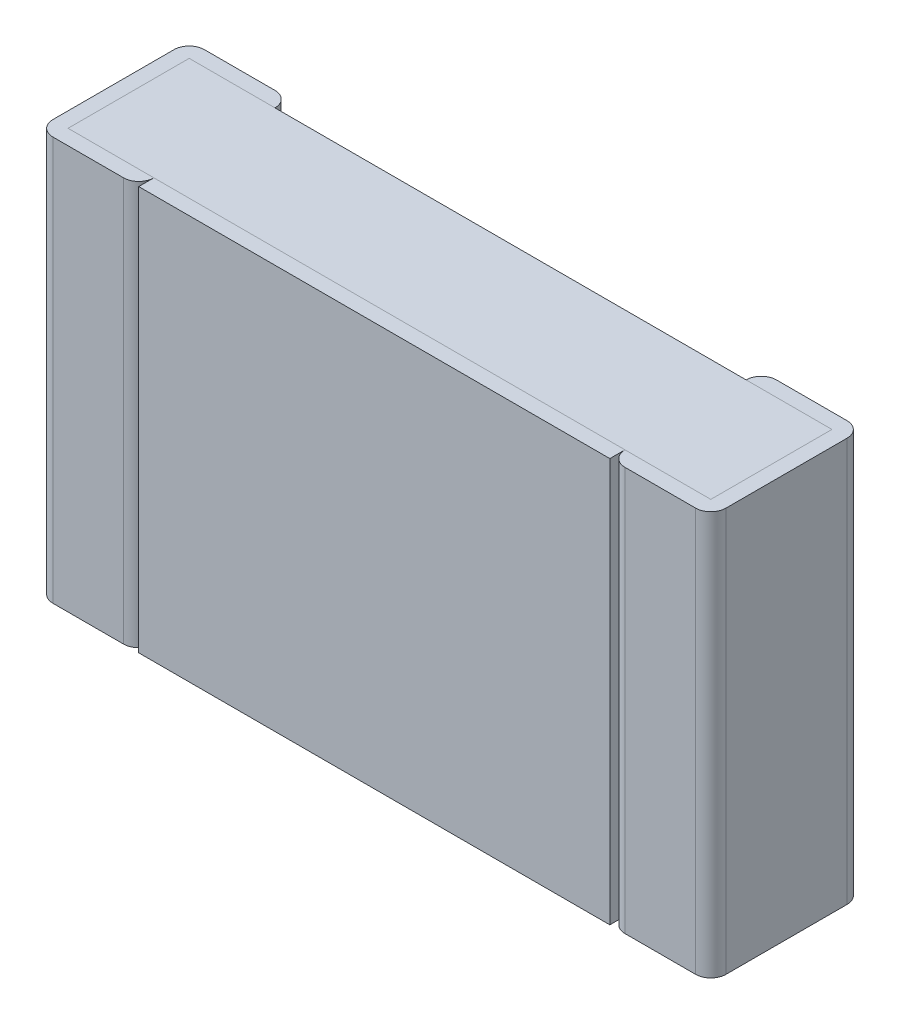
ISO-10303-21;
HEADER;
FILE_DESCRIPTION(('STEP AP214'),'2;1');
FILE_NAME('part.step','',(''),(''),'','','');
FILE_SCHEMA(('AUTOMOTIVE_DESIGN { 1 0 10303 214 1 1 1 1 }'));
ENDSEC;
DATA;
#1=APPLICATION_CONTEXT('core data for automotive mechanical design processes');
#2=APPLICATION_PROTOCOL_DEFINITION('international standard','automotive_design',2000,#1);
#3=PRODUCT_CONTEXT('',#1,'mechanical');
#4=PRODUCT('Part','Part','',(#3));
#5=PRODUCT_RELATED_PRODUCT_CATEGORY('part','',(#4));
#6=PRODUCT_DEFINITION_FORMATION('','',#4);
#7=PRODUCT_DEFINITION_CONTEXT('part definition',#1,'design');
#8=PRODUCT_DEFINITION('design','',#6,#7);
#9=PRODUCT_DEFINITION_SHAPE('','',#8);
#10=(LENGTH_UNIT() NAMED_UNIT(*) SI_UNIT(.MILLI.,.METRE.));
#11=(NAMED_UNIT(*) PLANE_ANGLE_UNIT() SI_UNIT($,.RADIAN.));
#12=(NAMED_UNIT(*) SI_UNIT($,.STERADIAN.) SOLID_ANGLE_UNIT());
#13=UNCERTAINTY_MEASURE_WITH_UNIT(LENGTH_MEASURE(1.E-05),#10,'distance_accuracy_value','');
#14=(GEOMETRIC_REPRESENTATION_CONTEXT(3) GLOBAL_UNCERTAINTY_ASSIGNED_CONTEXT((#13)) GLOBAL_UNIT_ASSIGNED_CONTEXT((#10,
#11,#12)) REPRESENTATION_CONTEXT('',''));
#15=CARTESIAN_POINT('',(0.,0.,0.));
#16=DIRECTION('',(0.,0.,1.));
#17=DIRECTION('',(1.,0.,0.));
#18=AXIS2_PLACEMENT_3D('',#15,#16,#17);
#19=CARTESIAN_POINT('',(-1.,-0.6,0.));
#20=DIRECTION('',(1.,0.,0.));
#21=DIRECTION('',(0.,1.,0.));
#22=AXIS2_PLACEMENT_3D('',#19,#20,#21);
#23=PLANE('',#22);
#24=DIRECTION('',(0.,1.,0.));
#25=VECTOR('',#24,1.);
#26=CARTESIAN_POINT('',(-1.,-0.6,0.405));
#27=LINE('',#26,#25);
#28=CARTESIAN_POINT('',(-1.,-0.6,0.405));
#29=VERTEX_POINT('',#28);
#30=CARTESIAN_POINT('',(-1.,0.6,0.405));
#31=VERTEX_POINT('',#30);
#32=EDGE_CURVE('E11',#29,#31,#27,.T.);
#33=ORIENTED_EDGE('',*,*,#32,.T.);
#34=DIRECTION('',(0.,0.,1.));
#35=VECTOR('',#34,1.);
#36=CARTESIAN_POINT('',(-1.,0.6,0.));
#37=LINE('',#36,#35);
#38=CARTESIAN_POINT('',(-1.,0.6,0.045));
#39=VERTEX_POINT('',#38);
#40=EDGE_CURVE('E41',#39,#31,#37,.T.);
#41=ORIENTED_EDGE('',*,*,#40,.F.);
#42=DIRECTION('',(0.,1.,0.));
#43=VECTOR('',#42,1.);
#44=CARTESIAN_POINT('',(-1.,-0.6,0.045));
#45=LINE('',#44,#43);
#46=CARTESIAN_POINT('',(-1.,-0.6,0.045));
#47=VERTEX_POINT('',#46);
#48=EDGE_CURVE('E328',#47,#39,#45,.T.);
#49=ORIENTED_EDGE('',*,*,#48,.F.);
#50=DIRECTION('',(0.,0.,1.));
#51=VECTOR('',#50,1.);
#52=CARTESIAN_POINT('',(-1.,-0.6,0.));
#53=LINE('',#52,#51);
#54=EDGE_CURVE('E27',#47,#29,#53,.T.);
#55=ORIENTED_EDGE('',*,*,#54,.T.);
#56=EDGE_LOOP('',(#33,#41,#49,#55));
#57=FACE_BOUND('',#56,.T.);
#58=ADVANCED_FACE('F16',(#57),#23,.F.);
#59=CARTESIAN_POINT('',(-1.,-0.6,0.));
#60=DIRECTION('',(0.,1.,0.));
#61=DIRECTION('',(1.,0.,0.));
#62=AXIS2_PLACEMENT_3D('',#59,#60,#61);
#63=PLANE('',#62);
#64=CARTESIAN_POINT('',(-0.745,-0.6,0.045));
#65=DIRECTION('',(0.,1.,0.));
#66=DIRECTION('',(0.,0.,1.));
#67=AXIS2_PLACEMENT_3D('',#64,#65,#66);
#68=CIRCLE('',#67,0.045);
#69=CARTESIAN_POINT('',(-0.7,-0.6,0.045));
#70=VERTEX_POINT('',#69);
#71=CARTESIAN_POINT('',(-0.745,-0.6,0.));
#72=VERTEX_POINT('',#71);
#73=EDGE_CURVE('E291',#70,#72,#68,.T.);
#74=ORIENTED_EDGE('',*,*,#73,.F.);
#75=DIRECTION('',(1.,0.,0.));
#76=VECTOR('',#75,1.);
#77=CARTESIAN_POINT('',(-0.955,-0.6,0.045));
#78=LINE('',#77,#76);
#79=CARTESIAN_POINT('',(-0.955,-0.6,0.045));
#80=VERTEX_POINT('',#79);
#81=EDGE_CURVE('E242',#80,#70,#78,.T.);
#82=ORIENTED_EDGE('',*,*,#81,.F.);
#83=DIRECTION('',(0.,0.,1.));
#84=VECTOR('',#83,1.);
#85=CARTESIAN_POINT('',(-0.955,-0.6,0.045));
#86=LINE('',#85,#84);
#87=CARTESIAN_POINT('',(-0.955,-0.6,0.405));
#88=VERTEX_POINT('',#87);
#89=EDGE_CURVE('E292',#80,#88,#86,.T.);
#90=ORIENTED_EDGE('',*,*,#89,.T.);
#91=DIRECTION('',(1.,0.,0.));
#92=VECTOR('',#91,1.);
#93=CARTESIAN_POINT('',(-0.955,-0.6,0.405));
#94=LINE('',#93,#92);
#95=CARTESIAN_POINT('',(-0.7,-0.6,0.405));
#96=VERTEX_POINT('',#95);
#97=EDGE_CURVE('E295',#88,#96,#94,.T.);
#98=ORIENTED_EDGE('',*,*,#97,.T.);
#99=CARTESIAN_POINT('',(-0.745,-0.6,0.405));
#100=DIRECTION('',(0.,-1.,0.));
#101=DIRECTION('',(0.,0.,1.));
#102=AXIS2_PLACEMENT_3D('',#99,#100,#101);
#103=CIRCLE('',#102,0.045);
#104=CARTESIAN_POINT('',(-0.745,-0.6,0.45));
#105=VERTEX_POINT('',#104);
#106=EDGE_CURVE('E363',#96,#105,#103,.T.);
#107=ORIENTED_EDGE('',*,*,#106,.T.);
#108=DIRECTION('',(1.,0.,0.));
#109=VECTOR('',#108,1.);
#110=CARTESIAN_POINT('',(-1.,-0.6,0.45));
#111=LINE('',#110,#109);
#112=CARTESIAN_POINT('',(-0.955,-0.6,0.45));
#113=VERTEX_POINT('',#112);
#114=EDGE_CURVE('E235',#113,#105,#111,.T.);
#115=ORIENTED_EDGE('',*,*,#114,.F.);
#116=CARTESIAN_POINT('',(-0.955,-0.6,0.405));
#117=DIRECTION('',(0.,1.,0.));
#118=DIRECTION('',(0.,0.,1.));
#119=AXIS2_PLACEMENT_3D('',#116,#117,#118);
#120=CIRCLE('',#119,0.045);
#121=EDGE_CURVE('E300',#29,#113,#120,.T.);
#122=ORIENTED_EDGE('',*,*,#121,.F.);
#123=ORIENTED_EDGE('',*,*,#54,.F.);
#124=CARTESIAN_POINT('',(-0.955,-0.6,0.045));
#125=DIRECTION('',(0.,-1.,0.));
#126=DIRECTION('',(0.,0.,1.));
#127=AXIS2_PLACEMENT_3D('',#124,#125,#126);
#128=CIRCLE('',#127,0.045);
#129=CARTESIAN_POINT('',(-0.955,-0.6,0.));
#130=VERTEX_POINT('',#129);
#131=EDGE_CURVE('E359',#47,#130,#128,.T.);
#132=ORIENTED_EDGE('',*,*,#131,.T.);
#133=DIRECTION('',(1.,0.,0.));
#134=VECTOR('',#133,1.);
#135=CARTESIAN_POINT('',(-1.,-0.6,0.));
#136=LINE('',#135,#134);
#137=EDGE_CURVE('E358',#130,#72,#136,.T.);
#138=ORIENTED_EDGE('',*,*,#137,.T.);
#139=EDGE_LOOP('',(#74,#82,#90,#98,#107,#115,#122,#123,#132,#138));
#140=FACE_BOUND('',#139,.T.);
#141=ADVANCED_FACE('F515',(#140),#63,.F.);
#142=CARTESIAN_POINT('',(-0.955,-0.6,0.045));
#143=DIRECTION('',(0.,1.,0.));
#144=DIRECTION('',(-1.,0.,0.));
#145=AXIS2_PLACEMENT_3D('',#142,#143,#144);
#146=CYLINDRICAL_SURFACE('',#145,0.045);
#147=ORIENTED_EDGE('',*,*,#48,.T.);
#148=CARTESIAN_POINT('',(-0.955,0.6,0.045));
#149=DIRECTION('',(0.,-1.,0.));
#150=DIRECTION('',(0.,0.,1.));
#151=AXIS2_PLACEMENT_3D('',#148,#149,#150);
#152=CIRCLE('',#151,0.045);
#153=CARTESIAN_POINT('',(-0.955,0.6,0.));
#154=VERTEX_POINT('',#153);
#155=EDGE_CURVE('E304',#39,#154,#152,.T.);
#156=ORIENTED_EDGE('',*,*,#155,.T.);
#157=DIRECTION('',(0.,1.,0.));
#158=VECTOR('',#157,1.);
#159=CARTESIAN_POINT('',(-0.955,-0.6,0.));
#160=LINE('',#159,#158);
#161=EDGE_CURVE('E346',#130,#154,#160,.T.);
#162=ORIENTED_EDGE('',*,*,#161,.F.);
#163=ORIENTED_EDGE('',*,*,#131,.F.);
#164=EDGE_LOOP('',(#147,#156,#162,#163));
#165=FACE_BOUND('',#164,.T.);
#166=ADVANCED_FACE('F559',(#165),#146,.T.);
#167=CARTESIAN_POINT('',(-0.955,-0.6,0.405));
#168=DIRECTION('',(0.,1.,0.));
#169=DIRECTION('',(-1.,0.,0.));
#170=AXIS2_PLACEMENT_3D('',#167,#168,#169);
#171=CYLINDRICAL_SURFACE('',#170,0.045);
#172=ORIENTED_EDGE('',*,*,#121,.T.);
#173=DIRECTION('',(0.,1.,0.));
#174=VECTOR('',#173,1.);
#175=CARTESIAN_POINT('',(-0.955,-0.6,0.45));
#176=LINE('',#175,#174);
#177=CARTESIAN_POINT('',(-0.955,0.6,0.45));
#178=VERTEX_POINT('',#177);
#179=EDGE_CURVE('E305',#113,#178,#176,.T.);
#180=ORIENTED_EDGE('',*,*,#179,.T.);
#181=CARTESIAN_POINT('',(-0.955,0.6,0.405));
#182=DIRECTION('',(0.,1.,0.));
#183=DIRECTION('',(0.,0.,1.));
#184=AXIS2_PLACEMENT_3D('',#181,#182,#183);
#185=CIRCLE('',#184,0.045);
#186=EDGE_CURVE('E227',#31,#178,#185,.T.);
#187=ORIENTED_EDGE('',*,*,#186,.F.);
#188=ORIENTED_EDGE('',*,*,#32,.F.);
#189=EDGE_LOOP('',(#172,#180,#187,#188));
#190=FACE_BOUND('',#189,.T.);
#191=ADVANCED_FACE('F571',(#190),#171,.T.);
#192=CARTESIAN_POINT('',(-1.,0.6,0.));
#193=DIRECTION('',(0.,1.,0.));
#194=DIRECTION('',(1.,0.,0.));
#195=AXIS2_PLACEMENT_3D('',#192,#193,#194);
#196=PLANE('',#195);
#197=DIRECTION('',(1.,0.,0.));
#198=VECTOR('',#197,1.);
#199=CARTESIAN_POINT('',(-1.,0.6,0.));
#200=LINE('',#199,#198);
#201=CARTESIAN_POINT('',(-0.745,0.6,0.));
#202=VERTEX_POINT('',#201);
#203=EDGE_CURVE('E343',#154,#202,#200,.T.);
#204=ORIENTED_EDGE('',*,*,#203,.F.);
#205=ORIENTED_EDGE('',*,*,#155,.F.);
#206=ORIENTED_EDGE('',*,*,#40,.T.);
#207=ORIENTED_EDGE('',*,*,#186,.T.);
#208=DIRECTION('',(1.,0.,0.));
#209=VECTOR('',#208,1.);
#210=CARTESIAN_POINT('',(-1.,0.6,0.45));
#211=LINE('',#210,#209);
#212=CARTESIAN_POINT('',(-0.745,0.6,0.45));
#213=VERTEX_POINT('',#212);
#214=EDGE_CURVE('E223',#178,#213,#211,.T.);
#215=ORIENTED_EDGE('',*,*,#214,.T.);
#216=CARTESIAN_POINT('',(-0.745,0.6,0.405));
#217=DIRECTION('',(0.,-1.,0.));
#218=DIRECTION('',(0.,0.,1.));
#219=AXIS2_PLACEMENT_3D('',#216,#217,#218);
#220=CIRCLE('',#219,0.045);
#221=CARTESIAN_POINT('',(-0.7,0.6,0.405));
#222=VERTEX_POINT('',#221);
#223=EDGE_CURVE('E210',#222,#213,#220,.T.);
#224=ORIENTED_EDGE('',*,*,#223,.F.);
#225=DIRECTION('',(1.,0.,0.));
#226=VECTOR('',#225,1.);
#227=CARTESIAN_POINT('',(-0.955,0.6,0.405));
#228=LINE('',#227,#226);
#229=CARTESIAN_POINT('',(-0.955,0.6,0.405));
#230=VERTEX_POINT('',#229);
#231=EDGE_CURVE('E317',#230,#222,#228,.T.);
#232=ORIENTED_EDGE('',*,*,#231,.F.);
#233=DIRECTION('',(0.,0.,1.));
#234=VECTOR('',#233,1.);
#235=CARTESIAN_POINT('',(-0.955,0.6,0.045));
#236=LINE('',#235,#234);
#237=CARTESIAN_POINT('',(-0.955,0.6,0.045));
#238=VERTEX_POINT('',#237);
#239=EDGE_CURVE('E220',#238,#230,#236,.T.);
#240=ORIENTED_EDGE('',*,*,#239,.F.);
#241=DIRECTION('',(1.,0.,0.));
#242=VECTOR('',#241,1.);
#243=CARTESIAN_POINT('',(-0.955,0.6,0.045));
#244=LINE('',#243,#242);
#245=CARTESIAN_POINT('',(-0.7,0.6,0.045));
#246=VERTEX_POINT('',#245);
#247=EDGE_CURVE('E232',#238,#246,#244,.T.);
#248=ORIENTED_EDGE('',*,*,#247,.T.);
#249=CARTESIAN_POINT('',(-0.745,0.6,0.045));
#250=DIRECTION('',(0.,1.,0.));
#251=DIRECTION('',(0.,0.,1.));
#252=AXIS2_PLACEMENT_3D('',#249,#250,#251);
#253=CIRCLE('',#252,0.045);
#254=EDGE_CURVE('E351',#246,#202,#253,.T.);
#255=ORIENTED_EDGE('',*,*,#254,.T.);
#256=EDGE_LOOP('',(#204,#205,#206,#207,#215,#224,#232,#240,#248,#255));
#257=FACE_BOUND('',#256,.T.);
#258=ADVANCED_FACE('F225',(#257),#196,.T.);
#259=CARTESIAN_POINT('',(-1.,-0.6,0.));
#260=DIRECTION('',(0.,0.,1.));
#261=DIRECTION('',(1.,0.,0.));
#262=AXIS2_PLACEMENT_3D('',#259,#260,#261);
#263=PLANE('',#262);
#264=DIRECTION('',(0.,1.,0.));
#265=VECTOR('',#264,1.);
#266=CARTESIAN_POINT('',(-0.745,-0.6,0.));
#267=LINE('',#266,#265);
#268=EDGE_CURVE('E287',#72,#202,#267,.T.);
#269=ORIENTED_EDGE('',*,*,#268,.F.);
#270=ORIENTED_EDGE('',*,*,#137,.F.);
#271=ORIENTED_EDGE('',*,*,#161,.T.);
#272=ORIENTED_EDGE('',*,*,#203,.T.);
#273=EDGE_LOOP('',(#269,#270,#271,#272));
#274=FACE_BOUND('',#273,.T.);
#275=ADVANCED_FACE('F565',(#274),#263,.F.);
#276=CARTESIAN_POINT('',(-0.745,-0.6,0.045));
#277=DIRECTION('',(0.,1.,0.));
#278=DIRECTION('',(1.,0.,0.));
#279=AXIS2_PLACEMENT_3D('',#276,#277,#278);
#280=CYLINDRICAL_SURFACE('',#279,0.045);
#281=ORIENTED_EDGE('',*,*,#73,.T.);
#282=ORIENTED_EDGE('',*,*,#268,.T.);
#283=ORIENTED_EDGE('',*,*,#254,.F.);
#284=DIRECTION('',(0.,1.,0.));
#285=VECTOR('',#284,1.);
#286=CARTESIAN_POINT('',(-0.7,-0.6,0.045));
#287=LINE('',#286,#285);
#288=EDGE_CURVE('E285',#70,#246,#287,.T.);
#289=ORIENTED_EDGE('',*,*,#288,.F.);
#290=EDGE_LOOP('',(#281,#282,#283,#289));
#291=FACE_BOUND('',#290,.T.);
#292=ADVANCED_FACE('F568',(#291),#280,.T.);
#293=CARTESIAN_POINT('',(-0.955,-0.6,0.045));
#294=DIRECTION('',(0.,1.,0.));
#295=DIRECTION('',(1.,0.,0.));
#296=AXIS2_PLACEMENT_3D('',#293,#294,#295);
#297=PLANE('',#296);
#298=DIRECTION('',(1.,0.,0.));
#299=VECTOR('',#298,1.);
#300=CARTESIAN_POINT('',(-0.955,-0.6,0.045));
#301=LINE('',#300,#299);
#302=CARTESIAN_POINT('',(0.7,-0.6,0.045));
#303=VERTEX_POINT('',#302);
#304=EDGE_CURVE('E279',#70,#303,#301,.T.);
#305=ORIENTED_EDGE('',*,*,#304,.T.);
#306=DIRECTION('',(1.,0.,0.));
#307=VECTOR('',#306,1.);
#308=CARTESIAN_POINT('',(-0.955,-0.6,0.045));
#309=LINE('',#308,#307);
#310=CARTESIAN_POINT('',(0.955,-0.6,0.045));
#311=VERTEX_POINT('',#310);
#312=EDGE_CURVE('E276',#303,#311,#309,.T.);
#313=ORIENTED_EDGE('',*,*,#312,.T.);
#314=DIRECTION('',(0.,0.,1.));
#315=VECTOR('',#314,1.);
#316=CARTESIAN_POINT('',(0.955,-0.6,0.045));
#317=LINE('',#316,#315);
#318=CARTESIAN_POINT('',(0.955,-0.6,0.405));
#319=VERTEX_POINT('',#318);
#320=EDGE_CURVE('E280',#311,#319,#317,.T.);
#321=ORIENTED_EDGE('',*,*,#320,.T.);
#322=DIRECTION('',(1.,0.,0.));
#323=VECTOR('',#322,1.);
#324=CARTESIAN_POINT('',(-0.955,-0.6,0.405));
#325=LINE('',#324,#323);
#326=CARTESIAN_POINT('',(0.7,-0.6,0.405));
#327=VERTEX_POINT('',#326);
#328=EDGE_CURVE('E251',#327,#319,#325,.T.);
#329=ORIENTED_EDGE('',*,*,#328,.F.);
#330=DIRECTION('',(1.,0.,0.));
#331=VECTOR('',#330,1.);
#332=CARTESIAN_POINT('',(-0.7,-0.6,0.405));
#333=LINE('',#332,#331);
#334=EDGE_CURVE('E367',#96,#327,#333,.T.);
#335=ORIENTED_EDGE('',*,*,#334,.F.);
#336=ORIENTED_EDGE('',*,*,#97,.F.);
#337=ORIENTED_EDGE('',*,*,#89,.F.);
#338=ORIENTED_EDGE('',*,*,#81,.T.);
#339=EDGE_LOOP('',(#305,#313,#321,#329,#335,#336,#337,#338));
#340=FACE_BOUND('',#339,.T.);
#341=ADVANCED_FACE('F518',(#340),#297,.F.);
#342=CARTESIAN_POINT('',(-1.,-0.6,0.45));
#343=DIRECTION('',(0.,0.,1.));
#344=DIRECTION('',(1.,0.,0.));
#345=AXIS2_PLACEMENT_3D('',#342,#343,#344);
#346=PLANE('',#345);
#347=ORIENTED_EDGE('',*,*,#214,.F.);
#348=ORIENTED_EDGE('',*,*,#179,.F.);
#349=ORIENTED_EDGE('',*,*,#114,.T.);
#350=DIRECTION('',(0.,1.,0.));
#351=VECTOR('',#350,1.);
#352=CARTESIAN_POINT('',(-0.745,-0.6,0.45));
#353=LINE('',#352,#351);
#354=EDGE_CURVE('E215',#105,#213,#353,.T.);
#355=ORIENTED_EDGE('',*,*,#354,.T.);
#356=EDGE_LOOP('',(#347,#348,#349,#355));
#357=FACE_BOUND('',#356,.T.);
#358=ADVANCED_FACE('F234',(#357),#346,.T.);
#359=CARTESIAN_POINT('',(-0.745,-0.6,0.405));
#360=DIRECTION('',(0.,1.,0.));
#361=DIRECTION('',(1.,0.,0.));
#362=AXIS2_PLACEMENT_3D('',#359,#360,#361);
#363=CYLINDRICAL_SURFACE('',#362,0.045);
#364=DIRECTION('',(0.,1.,0.));
#365=VECTOR('',#364,1.);
#366=CARTESIAN_POINT('',(-0.7,-0.6,0.405));
#367=LINE('',#366,#365);
#368=EDGE_CURVE('E217',#96,#222,#367,.T.);
#369=ORIENTED_EDGE('',*,*,#368,.T.);
#370=ORIENTED_EDGE('',*,*,#223,.T.);
#371=ORIENTED_EDGE('',*,*,#354,.F.);
#372=ORIENTED_EDGE('',*,*,#106,.F.);
#373=EDGE_LOOP('',(#369,#370,#371,#372));
#374=FACE_BOUND('',#373,.T.);
#375=ADVANCED_FACE('F212',(#374),#363,.T.);
#376=CARTESIAN_POINT('',(-0.955,0.6,0.045));
#377=DIRECTION('',(0.,1.,0.));
#378=DIRECTION('',(1.,0.,0.));
#379=AXIS2_PLACEMENT_3D('',#376,#377,#378);
#380=PLANE('',#379);
#381=ORIENTED_EDGE('',*,*,#247,.F.);
#382=ORIENTED_EDGE('',*,*,#239,.T.);
#383=ORIENTED_EDGE('',*,*,#231,.T.);
#384=DIRECTION('',(1.,0.,0.));
#385=VECTOR('',#384,1.);
#386=CARTESIAN_POINT('',(-0.7,0.6,0.405));
#387=LINE('',#386,#385);
#388=CARTESIAN_POINT('',(0.7,0.6,0.405));
#389=VERTEX_POINT('',#388);
#390=EDGE_CURVE('E262',#222,#389,#387,.T.);
#391=ORIENTED_EDGE('',*,*,#390,.T.);
#392=DIRECTION('',(1.,0.,0.));
#393=VECTOR('',#392,1.);
#394=CARTESIAN_POINT('',(-0.955,0.6,0.405));
#395=LINE('',#394,#393);
#396=CARTESIAN_POINT('',(0.955,0.6,0.405));
#397=VERTEX_POINT('',#396);
#398=EDGE_CURVE('E259',#389,#397,#395,.T.);
#399=ORIENTED_EDGE('',*,*,#398,.T.);
#400=DIRECTION('',(0.,0.,1.));
#401=VECTOR('',#400,1.);
#402=CARTESIAN_POINT('',(0.955,0.6,0.045));
#403=LINE('',#402,#401);
#404=CARTESIAN_POINT('',(0.955,0.6,0.045));
#405=VERTEX_POINT('',#404);
#406=EDGE_CURVE('E337',#405,#397,#403,.T.);
#407=ORIENTED_EDGE('',*,*,#406,.F.);
#408=DIRECTION('',(1.,0.,0.));
#409=VECTOR('',#408,1.);
#410=CARTESIAN_POINT('',(-0.955,0.6,0.045));
#411=LINE('',#410,#409);
#412=CARTESIAN_POINT('',(0.7,0.6,0.045));
#413=VERTEX_POINT('',#412);
#414=EDGE_CURVE('E269',#413,#405,#411,.T.);
#415=ORIENTED_EDGE('',*,*,#414,.F.);
#416=DIRECTION('',(1.,0.,0.));
#417=VECTOR('',#416,1.);
#418=CARTESIAN_POINT('',(-0.955,0.6,0.045));
#419=LINE('',#418,#417);
#420=EDGE_CURVE('E263',#246,#413,#419,.T.);
#421=ORIENTED_EDGE('',*,*,#420,.F.);
#422=EDGE_LOOP('',(#381,#382,#383,#391,#399,#407,#415,#421));
#423=FACE_BOUND('',#422,.T.);
#424=ADVANCED_FACE('F495',(#423),#380,.T.);
#425=CARTESIAN_POINT('',(-0.955,-0.6,0.045));
#426=DIRECTION('',(0.,0.,1.));
#427=DIRECTION('',(1.,0.,0.));
#428=AXIS2_PLACEMENT_3D('',#425,#426,#427);
#429=PLANE('',#428);
#430=ORIENTED_EDGE('',*,*,#420,.T.);
#431=DIRECTION('',(0.,1.,0.));
#432=VECTOR('',#431,1.);
#433=CARTESIAN_POINT('',(0.7,-0.6,0.045));
#434=LINE('',#433,#432);
#435=EDGE_CURVE('E412',#303,#413,#434,.T.);
#436=ORIENTED_EDGE('',*,*,#435,.F.);
#437=ORIENTED_EDGE('',*,*,#304,.F.);
#438=ORIENTED_EDGE('',*,*,#288,.T.);
#439=EDGE_LOOP('',(#430,#436,#437,#438));
#440=FACE_BOUND('',#439,.T.);
#441=ADVANCED_FACE('F538',(#440),#429,.F.);
#442=CARTESIAN_POINT('',(0.7,-0.6,0.));
#443=DIRECTION('',(0.,1.,0.));
#444=DIRECTION('',(1.,0.,0.));
#445=AXIS2_PLACEMENT_3D('',#442,#443,#444);
#446=PLANE('',#445);
#447=CARTESIAN_POINT('',(0.955,-0.6,0.045));
#448=DIRECTION('',(0.,1.,0.));
#449=DIRECTION('',(0.,0.,1.));
#450=AXIS2_PLACEMENT_3D('',#447,#448,#449);
#451=CIRCLE('',#450,0.045);
#452=CARTESIAN_POINT('',(1.,-0.6,0.045));
#453=VERTEX_POINT('',#452);
#454=CARTESIAN_POINT('',(0.955,-0.6,0.));
#455=VERTEX_POINT('',#454);
#456=EDGE_CURVE('E376',#453,#455,#451,.T.);
#457=ORIENTED_EDGE('',*,*,#456,.F.);
#458=DIRECTION('',(0.,0.,1.));
#459=VECTOR('',#458,1.);
#460=CARTESIAN_POINT('',(1.,-0.6,0.));
#461=LINE('',#460,#459);
#462=CARTESIAN_POINT('',(1.,-0.6,0.405));
#463=VERTEX_POINT('',#462);
#464=EDGE_CURVE('E281',#453,#463,#461,.T.);
#465=ORIENTED_EDGE('',*,*,#464,.T.);
#466=CARTESIAN_POINT('',(0.955,-0.6,0.405));
#467=DIRECTION('',(0.,-1.,0.));
#468=DIRECTION('',(0.,0.,1.));
#469=AXIS2_PLACEMENT_3D('',#466,#467,#468);
#470=CIRCLE('',#469,0.045);
#471=CARTESIAN_POINT('',(0.955,-0.6,0.45));
#472=VERTEX_POINT('',#471);
#473=EDGE_CURVE('E286',#463,#472,#470,.T.);
#474=ORIENTED_EDGE('',*,*,#473,.T.);
#475=DIRECTION('',(1.,0.,0.));
#476=VECTOR('',#475,1.);
#477=CARTESIAN_POINT('',(0.7,-0.6,0.45));
#478=LINE('',#477,#476);
#479=CARTESIAN_POINT('',(0.745,-0.6,0.45));
#480=VERTEX_POINT('',#479);
#481=EDGE_CURVE('E299',#480,#472,#478,.T.);
#482=ORIENTED_EDGE('',*,*,#481,.F.);
#483=CARTESIAN_POINT('',(0.745,-0.6,0.405));
#484=DIRECTION('',(0.,1.,0.));
#485=DIRECTION('',(0.,0.,1.));
#486=AXIS2_PLACEMENT_3D('',#483,#484,#485);
#487=CIRCLE('',#486,0.045);
#488=EDGE_CURVE('E461',#327,#480,#487,.T.);
#489=ORIENTED_EDGE('',*,*,#488,.F.);
#490=ORIENTED_EDGE('',*,*,#328,.T.);
#491=ORIENTED_EDGE('',*,*,#320,.F.);
#492=ORIENTED_EDGE('',*,*,#312,.F.);
#493=CARTESIAN_POINT('',(0.745,-0.6,0.045));
#494=DIRECTION('',(0.,-1.,0.));
#495=DIRECTION('',(0.,0.,1.));
#496=AXIS2_PLACEMENT_3D('',#493,#494,#495);
#497=CIRCLE('',#496,0.045);
#498=CARTESIAN_POINT('',(0.745,-0.6,0.));
#499=VERTEX_POINT('',#498);
#500=EDGE_CURVE('E248',#303,#499,#497,.T.);
#501=ORIENTED_EDGE('',*,*,#500,.T.);
#502=DIRECTION('',(1.,0.,0.));
#503=VECTOR('',#502,1.);
#504=CARTESIAN_POINT('',(0.7,-0.6,0.));
#505=LINE('',#504,#503);
#506=EDGE_CURVE('E252',#499,#455,#505,.T.);
#507=ORIENTED_EDGE('',*,*,#506,.T.);
#508=EDGE_LOOP('',(#457,#465,#474,#482,#489,#490,#491,#492,#501,#507));
#509=FACE_BOUND('',#508,.T.);
#510=ADVANCED_FACE('F520',(#509),#446,.F.);
#511=CARTESIAN_POINT('',(-0.7,-0.6,0.405));
#512=DIRECTION('',(0.,1.,0.));
#513=DIRECTION('',(1.,0.,0.));
#514=AXIS2_PLACEMENT_3D('',#511,#512,#513);
#515=PLANE('',#514);
#516=DIRECTION('',(0.,0.,1.));
#517=VECTOR('',#516,1.);
#518=CARTESIAN_POINT('',(0.7,-0.6,0.405));
#519=LINE('',#518,#517);
#520=CARTESIAN_POINT('',(0.7,-0.6,0.45));
#521=VERTEX_POINT('',#520);
#522=EDGE_CURVE('E371',#327,#521,#519,.T.);
#523=ORIENTED_EDGE('',*,*,#522,.T.);
#524=DIRECTION('',(1.,0.,0.));
#525=VECTOR('',#524,1.);
#526=CARTESIAN_POINT('',(-0.7,-0.6,0.45));
#527=LINE('',#526,#525);
#528=CARTESIAN_POINT('',(-0.7,-0.6,0.45));
#529=VERTEX_POINT('',#528);
#530=EDGE_CURVE('E313',#529,#521,#527,.T.);
#531=ORIENTED_EDGE('',*,*,#530,.F.);
#532=DIRECTION('',(0.,0.,1.));
#533=VECTOR('',#532,1.);
#534=CARTESIAN_POINT('',(-0.7,-0.6,0.405));
#535=LINE('',#534,#533);
#536=EDGE_CURVE('E264',#96,#529,#535,.T.);
#537=ORIENTED_EDGE('',*,*,#536,.F.);
#538=ORIENTED_EDGE('',*,*,#334,.T.);
#539=EDGE_LOOP('',(#523,#531,#537,#538));
#540=FACE_BOUND('',#539,.T.);
#541=ADVANCED_FACE('F509',(#540),#515,.F.);
#542=CARTESIAN_POINT('',(-0.7,-0.6,0.405));
#543=DIRECTION('',(1.,0.,0.));
#544=DIRECTION('',(0.,1.,0.));
#545=AXIS2_PLACEMENT_3D('',#542,#543,#544);
#546=PLANE('',#545);
#547=DIRECTION('',(0.,1.,0.));
#548=VECTOR('',#547,1.);
#549=CARTESIAN_POINT('',(-0.7,-0.6,0.45));
#550=LINE('',#549,#548);
#551=CARTESIAN_POINT('',(-0.7,0.6,0.45));
#552=VERTEX_POINT('',#551);
#553=EDGE_CURVE('E268',#529,#552,#550,.T.);
#554=ORIENTED_EDGE('',*,*,#553,.T.);
#555=DIRECTION('',(0.,0.,1.));
#556=VECTOR('',#555,1.);
#557=CARTESIAN_POINT('',(-0.7,0.6,0.405));
#558=LINE('',#557,#556);
#559=EDGE_CURVE('E333',#222,#552,#558,.T.);
#560=ORIENTED_EDGE('',*,*,#559,.F.);
#561=ORIENTED_EDGE('',*,*,#368,.F.);
#562=ORIENTED_EDGE('',*,*,#536,.T.);
#563=EDGE_LOOP('',(#554,#560,#561,#562));
#564=FACE_BOUND('',#563,.T.);
#565=ADVANCED_FACE('F511',(#564),#546,.F.);
#566=CARTESIAN_POINT('',(0.7,0.6,0.));
#567=DIRECTION('',(0.,1.,0.));
#568=DIRECTION('',(1.,0.,0.));
#569=AXIS2_PLACEMENT_3D('',#566,#567,#568);
#570=PLANE('',#569);
#571=DIRECTION('',(1.,0.,0.));
#572=VECTOR('',#571,1.);
#573=CARTESIAN_POINT('',(0.7,0.6,0.));
#574=LINE('',#573,#572);
#575=CARTESIAN_POINT('',(0.745,0.6,0.));
#576=VERTEX_POINT('',#575);
#577=CARTESIAN_POINT('',(0.955,0.6,0.));
#578=VERTEX_POINT('',#577);
#579=EDGE_CURVE('E419',#576,#578,#574,.T.);
#580=ORIENTED_EDGE('',*,*,#579,.F.);
#581=CARTESIAN_POINT('',(0.745,0.6,0.045));
#582=DIRECTION('',(0.,-1.,0.));
#583=DIRECTION('',(0.,0.,1.));
#584=AXIS2_PLACEMENT_3D('',#581,#582,#583);
#585=CIRCLE('',#584,0.045);
#586=EDGE_CURVE('E408',#413,#576,#585,.T.);
#587=ORIENTED_EDGE('',*,*,#586,.F.);
#588=ORIENTED_EDGE('',*,*,#414,.T.);
#589=ORIENTED_EDGE('',*,*,#406,.T.);
#590=ORIENTED_EDGE('',*,*,#398,.F.);
#591=CARTESIAN_POINT('',(0.745,0.6,0.405));
#592=DIRECTION('',(0.,1.,0.));
#593=DIRECTION('',(0.,0.,1.));
#594=AXIS2_PLACEMENT_3D('',#591,#592,#593);
#595=CIRCLE('',#594,0.045);
#596=CARTESIAN_POINT('',(0.745,0.6,0.45));
#597=VERTEX_POINT('',#596);
#598=EDGE_CURVE('E257',#389,#597,#595,.T.);
#599=ORIENTED_EDGE('',*,*,#598,.T.);
#600=DIRECTION('',(1.,0.,0.));
#601=VECTOR('',#600,1.);
#602=CARTESIAN_POINT('',(0.7,0.6,0.45));
#603=LINE('',#602,#601);
#604=CARTESIAN_POINT('',(0.955,0.6,0.45));
#605=VERTEX_POINT('',#604);
#606=EDGE_CURVE('E253',#597,#605,#603,.T.);
#607=ORIENTED_EDGE('',*,*,#606,.T.);
#608=CARTESIAN_POINT('',(0.955,0.6,0.405));
#609=DIRECTION('',(0.,-1.,0.));
#610=DIRECTION('',(0.,0.,1.));
#611=AXIS2_PLACEMENT_3D('',#608,#609,#610);
#612=CIRCLE('',#611,0.045);
#613=CARTESIAN_POINT('',(1.,0.6,0.405));
#614=VERTEX_POINT('',#613);
#615=EDGE_CURVE('E296',#614,#605,#612,.T.);
#616=ORIENTED_EDGE('',*,*,#615,.F.);
#617=DIRECTION('',(0.,0.,1.));
#618=VECTOR('',#617,1.);
#619=CARTESIAN_POINT('',(1.,0.6,0.));
#620=LINE('',#619,#618);
#621=CARTESIAN_POINT('',(1.,0.6,0.045));
#622=VERTEX_POINT('',#621);
#623=EDGE_CURVE('E270',#622,#614,#620,.T.);
#624=ORIENTED_EDGE('',*,*,#623,.F.);
#625=CARTESIAN_POINT('',(0.955,0.6,0.045));
#626=DIRECTION('',(0.,1.,0.));
#627=DIRECTION('',(0.,0.,1.));
#628=AXIS2_PLACEMENT_3D('',#625,#626,#627);
#629=CIRCLE('',#628,0.045);
#630=EDGE_CURVE('E258',#622,#578,#629,.T.);
#631=ORIENTED_EDGE('',*,*,#630,.T.);
#632=EDGE_LOOP('',(#580,#587,#588,#589,#590,#599,#607,#616,#624,#631));
#633=FACE_BOUND('',#632,.T.);
#634=ADVANCED_FACE('F491',(#633),#570,.T.);
#635=CARTESIAN_POINT('',(-0.7,0.6,0.405));
#636=DIRECTION('',(0.,1.,0.));
#637=DIRECTION('',(1.,0.,0.));
#638=AXIS2_PLACEMENT_3D('',#635,#636,#637);
#639=PLANE('',#638);
#640=ORIENTED_EDGE('',*,*,#390,.F.);
#641=ORIENTED_EDGE('',*,*,#559,.T.);
#642=DIRECTION('',(1.,0.,0.));
#643=VECTOR('',#642,1.);
#644=CARTESIAN_POINT('',(-0.7,0.6,0.45));
#645=LINE('',#644,#643);
#646=CARTESIAN_POINT('',(0.7,0.6,0.45));
#647=VERTEX_POINT('',#646);
#648=EDGE_CURVE('E340',#552,#647,#645,.T.);
#649=ORIENTED_EDGE('',*,*,#648,.T.);
#650=DIRECTION('',(0.,0.,1.));
#651=VECTOR('',#650,1.);
#652=CARTESIAN_POINT('',(0.7,0.6,0.405));
#653=LINE('',#652,#651);
#654=EDGE_CURVE('E309',#389,#647,#653,.T.);
#655=ORIENTED_EDGE('',*,*,#654,.F.);
#656=EDGE_LOOP('',(#640,#641,#649,#655));
#657=FACE_BOUND('',#656,.T.);
#658=ADVANCED_FACE('F501',(#657),#639,.T.);
#659=CARTESIAN_POINT('',(0.745,-0.6,0.045));
#660=DIRECTION('',(0.,1.,0.));
#661=DIRECTION('',(-1.,0.,0.));
#662=AXIS2_PLACEMENT_3D('',#659,#660,#661);
#663=CYLINDRICAL_SURFACE('',#662,0.045);
#664=ORIENTED_EDGE('',*,*,#435,.T.);
#665=ORIENTED_EDGE('',*,*,#586,.T.);
#666=DIRECTION('',(0.,1.,0.));
#667=VECTOR('',#666,1.);
#668=CARTESIAN_POINT('',(0.745,-0.6,0.));
#669=LINE('',#668,#667);
#670=EDGE_CURVE('E413',#499,#576,#669,.T.);
#671=ORIENTED_EDGE('',*,*,#670,.F.);
#672=ORIENTED_EDGE('',*,*,#500,.F.);
#673=EDGE_LOOP('',(#664,#665,#671,#672));
#674=FACE_BOUND('',#673,.T.);
#675=ADVANCED_FACE('F534',(#674),#663,.T.);
#676=CARTESIAN_POINT('',(0.7,-0.6,0.));
#677=DIRECTION('',(0.,0.,1.));
#678=DIRECTION('',(1.,0.,0.));
#679=AXIS2_PLACEMENT_3D('',#676,#677,#678);
#680=PLANE('',#679);
#681=DIRECTION('',(0.,1.,0.));
#682=VECTOR('',#681,1.);
#683=CARTESIAN_POINT('',(0.955,-0.6,0.));
#684=LINE('',#683,#682);
#685=EDGE_CURVE('E372',#455,#578,#684,.T.);
#686=ORIENTED_EDGE('',*,*,#685,.F.);
#687=ORIENTED_EDGE('',*,*,#506,.F.);
#688=ORIENTED_EDGE('',*,*,#670,.T.);
#689=ORIENTED_EDGE('',*,*,#579,.T.);
#690=EDGE_LOOP('',(#686,#687,#688,#689));
#691=FACE_BOUND('',#690,.T.);
#692=ADVANCED_FACE('F537',(#691),#680,.F.);
#693=CARTESIAN_POINT('',(0.955,-0.6,0.045));
#694=DIRECTION('',(0.,1.,0.));
#695=DIRECTION('',(1.,0.,0.));
#696=AXIS2_PLACEMENT_3D('',#693,#694,#695);
#697=CYLINDRICAL_SURFACE('',#696,0.045);
#698=ORIENTED_EDGE('',*,*,#456,.T.);
#699=ORIENTED_EDGE('',*,*,#685,.T.);
#700=ORIENTED_EDGE('',*,*,#630,.F.);
#701=DIRECTION('',(0.,1.,0.));
#702=VECTOR('',#701,1.);
#703=CARTESIAN_POINT('',(1.,-0.6,0.045));
#704=LINE('',#703,#702);
#705=EDGE_CURVE('E274',#453,#622,#704,.T.);
#706=ORIENTED_EDGE('',*,*,#705,.F.);
#707=EDGE_LOOP('',(#698,#699,#700,#706));
#708=FACE_BOUND('',#707,.T.);
#709=ADVANCED_FACE('F18',(#708),#697,.T.);
#710=CARTESIAN_POINT('',(1.,-0.6,0.));
#711=DIRECTION('',(1.,0.,0.));
#712=DIRECTION('',(0.,1.,0.));
#713=AXIS2_PLACEMENT_3D('',#710,#711,#712);
#714=PLANE('',#713);
#715=ORIENTED_EDGE('',*,*,#464,.F.);
#716=ORIENTED_EDGE('',*,*,#705,.T.);
#717=ORIENTED_EDGE('',*,*,#623,.T.);
#718=DIRECTION('',(0.,1.,0.));
#719=VECTOR('',#718,1.);
#720=CARTESIAN_POINT('',(1.,-0.6,0.405));
#721=LINE('',#720,#719);
#722=EDGE_CURVE('E275',#463,#614,#721,.T.);
#723=ORIENTED_EDGE('',*,*,#722,.F.);
#724=EDGE_LOOP('',(#715,#716,#717,#723));
#725=FACE_BOUND('',#724,.T.);
#726=ADVANCED_FACE('F528',(#725),#714,.T.);
#727=CARTESIAN_POINT('',(0.955,-0.6,0.405));
#728=DIRECTION('',(0.,1.,0.));
#729=DIRECTION('',(1.,0.,0.));
#730=AXIS2_PLACEMENT_3D('',#727,#728,#729);
#731=CYLINDRICAL_SURFACE('',#730,0.045);
#732=ORIENTED_EDGE('',*,*,#722,.T.);
#733=ORIENTED_EDGE('',*,*,#615,.T.);
#734=DIRECTION('',(0.,1.,0.));
#735=VECTOR('',#734,1.);
#736=CARTESIAN_POINT('',(0.955,-0.6,0.45));
#737=LINE('',#736,#735);
#738=EDGE_CURVE('E320',#472,#605,#737,.T.);
#739=ORIENTED_EDGE('',*,*,#738,.F.);
#740=ORIENTED_EDGE('',*,*,#473,.F.);
#741=EDGE_LOOP('',(#732,#733,#739,#740));
#742=FACE_BOUND('',#741,.T.);
#743=ADVANCED_FACE('F525',(#742),#731,.T.);
#744=CARTESIAN_POINT('',(0.7,-0.6,0.45));
#745=DIRECTION('',(0.,0.,1.));
#746=DIRECTION('',(1.,0.,0.));
#747=AXIS2_PLACEMENT_3D('',#744,#745,#746);
#748=PLANE('',#747);
#749=ORIENTED_EDGE('',*,*,#606,.F.);
#750=DIRECTION('',(0.,1.,0.));
#751=VECTOR('',#750,1.);
#752=CARTESIAN_POINT('',(0.745,-0.6,0.45));
#753=LINE('',#752,#751);
#754=EDGE_CURVE('E20',#480,#597,#753,.T.);
#755=ORIENTED_EDGE('',*,*,#754,.F.);
#756=ORIENTED_EDGE('',*,*,#481,.T.);
#757=ORIENTED_EDGE('',*,*,#738,.T.);
#758=EDGE_LOOP('',(#749,#755,#756,#757));
#759=FACE_BOUND('',#758,.T.);
#760=ADVANCED_FACE('F488',(#759),#748,.T.);
#761=CARTESIAN_POINT('',(0.745,-0.6,0.405));
#762=DIRECTION('',(0.,1.,0.));
#763=DIRECTION('',(-1.,0.,0.));
#764=AXIS2_PLACEMENT_3D('',#761,#762,#763);
#765=CYLINDRICAL_SURFACE('',#764,0.045);
#766=ORIENTED_EDGE('',*,*,#488,.T.);
#767=ORIENTED_EDGE('',*,*,#754,.T.);
#768=ORIENTED_EDGE('',*,*,#598,.F.);
#769=DIRECTION('',(0.,1.,0.));
#770=VECTOR('',#769,1.);
#771=CARTESIAN_POINT('',(0.7,-0.6,0.405));
#772=LINE('',#771,#770);
#773=EDGE_CURVE('E312',#327,#389,#772,.T.);
#774=ORIENTED_EDGE('',*,*,#773,.F.);
#775=EDGE_LOOP('',(#766,#767,#768,#774));
#776=FACE_BOUND('',#775,.T.);
#777=ADVANCED_FACE('F484',(#776),#765,.T.);
#778=CARTESIAN_POINT('',(0.7,-0.6,0.405));
#779=DIRECTION('',(1.,0.,0.));
#780=DIRECTION('',(0.,1.,0.));
#781=AXIS2_PLACEMENT_3D('',#778,#779,#780);
#782=PLANE('',#781);
#783=ORIENTED_EDGE('',*,*,#522,.F.);
#784=ORIENTED_EDGE('',*,*,#773,.T.);
#785=ORIENTED_EDGE('',*,*,#654,.T.);
#786=DIRECTION('',(0.,1.,0.));
#787=VECTOR('',#786,1.);
#788=CARTESIAN_POINT('',(0.7,-0.6,0.45));
#789=LINE('',#788,#787);
#790=EDGE_CURVE('E427',#521,#647,#789,.T.);
#791=ORIENTED_EDGE('',*,*,#790,.F.);
#792=EDGE_LOOP('',(#783,#784,#785,#791));
#793=FACE_BOUND('',#792,.T.);
#794=ADVANCED_FACE('F503',(#793),#782,.T.);
#795=CARTESIAN_POINT('',(-0.7,-0.6,0.45));
#796=DIRECTION('',(0.,0.,1.));
#797=DIRECTION('',(1.,0.,0.));
#798=AXIS2_PLACEMENT_3D('',#795,#796,#797);
#799=PLANE('',#798);
#800=ORIENTED_EDGE('',*,*,#553,.F.);
#801=ORIENTED_EDGE('',*,*,#530,.T.);
#802=ORIENTED_EDGE('',*,*,#790,.T.);
#803=ORIENTED_EDGE('',*,*,#648,.F.);
#804=EDGE_LOOP('',(#800,#801,#802,#803));
#805=FACE_BOUND('',#804,.T.);
#806=ADVANCED_FACE('F507',(#805),#799,.T.);
#807=CLOSED_SHELL('',(#58,#141,#166,#191,#258,#275,#292,#341,#358,#375,#424,#441,#510,#541,#565,
#634,#658,#675,#692,#709,#726,#743,#760,#777,#794,#806));
#808=MANIFOLD_SOLID_BREP('B1',#807);
#809=ADVANCED_BREP_SHAPE_REPRESENTATION('',(#18,#808),#14);
#810=SHAPE_DEFINITION_REPRESENTATION(#9,#809);
ENDSEC;
END-ISO-10303-21;
